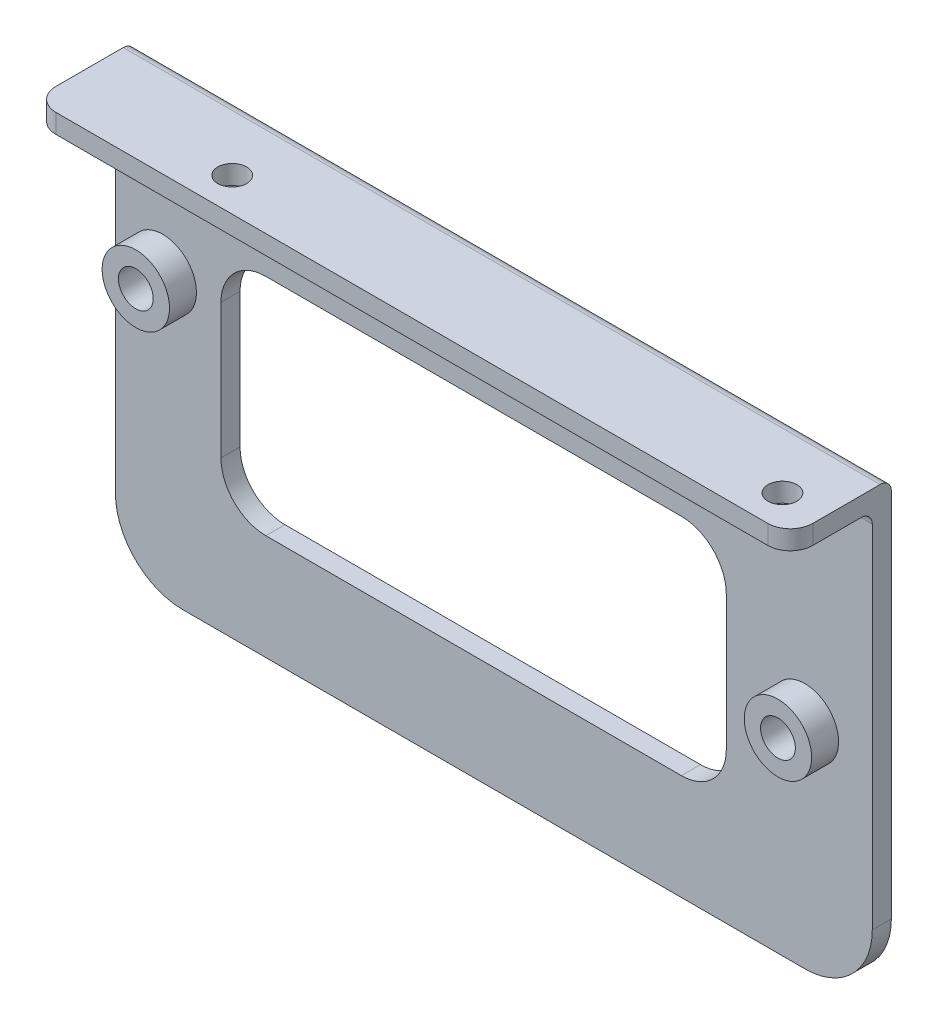
ISO-10303-21;
HEADER;
FILE_DESCRIPTION(('STEP AP214'),'2;1');
FILE_NAME('part.step','',(''),(''),'','','');
FILE_SCHEMA(('AUTOMOTIVE_DESIGN { 1 0 10303 214 1 1 1 1 }'));
ENDSEC;
DATA;
#1=APPLICATION_CONTEXT('core data for automotive mechanical design processes');
#2=APPLICATION_PROTOCOL_DEFINITION('international standard','automotive_design',2000,#1);
#3=PRODUCT_CONTEXT('',#1,'mechanical');
#4=PRODUCT('Part','Part','',(#3));
#5=PRODUCT_RELATED_PRODUCT_CATEGORY('part','',(#4));
#6=PRODUCT_DEFINITION_FORMATION('','',#4);
#7=PRODUCT_DEFINITION_CONTEXT('part definition',#1,'design');
#8=PRODUCT_DEFINITION('design','',#6,#7);
#9=PRODUCT_DEFINITION_SHAPE('','',#8);
#10=(LENGTH_UNIT() NAMED_UNIT(*) SI_UNIT(.MILLI.,.METRE.));
#11=(NAMED_UNIT(*) PLANE_ANGLE_UNIT() SI_UNIT($,.RADIAN.));
#12=(NAMED_UNIT(*) SI_UNIT($,.STERADIAN.) SOLID_ANGLE_UNIT());
#13=UNCERTAINTY_MEASURE_WITH_UNIT(LENGTH_MEASURE(1.E-05),#10,'distance_accuracy_value','');
#14=(GEOMETRIC_REPRESENTATION_CONTEXT(3) GLOBAL_UNCERTAINTY_ASSIGNED_CONTEXT((#13)) GLOBAL_UNIT_ASSIGNED_CONTEXT((#10,
#11,#12)) REPRESENTATION_CONTEXT('',''));
#15=CARTESIAN_POINT('',(0.,0.,0.));
#16=DIRECTION('',(0.,0.,1.));
#17=DIRECTION('',(1.,0.,0.));
#18=AXIS2_PLACEMENT_3D('',#15,#16,#17);
#19=CARTESIAN_POINT('',(0.,0.,2.159));
#20=DIRECTION('',(0.,0.,-1.));
#21=DIRECTION('',(-1.,0.,0.));
#22=AXIS2_PLACEMENT_3D('',#19,#20,#21);
#23=PLANE('',#22);
#24=CARTESIAN_POINT('',(-37.44214,6.42619999999999,2.159));
#25=DIRECTION('',(0.,0.,-1.));
#26=DIRECTION('',(-1.,0.,0.));
#27=AXIS2_PLACEMENT_3D('',#24,#25,#26);
#28=CIRCLE('',#27,3.81);
#29=CARTESIAN_POINT('',(-41.25214,6.42619999999999,2.159));
#30=VERTEX_POINT('',#29);
#31=EDGE_CURVE('E11',#30,#30,#28,.F.);
#32=ORIENTED_EDGE('',*,*,#31,.F.);
#33=EDGE_LOOP('',(#32));
#34=FACE_BOUND('',#33,.T.);
#35=CARTESIAN_POINT('',(35.179,-1.27000000000001,2.159));
#36=DIRECTION('',(0.,0.,-1.));
#37=DIRECTION('',(-1.,0.,0.));
#38=AXIS2_PLACEMENT_3D('',#35,#36,#37);
#39=CIRCLE('',#38,3.81);
#40=CARTESIAN_POINT('',(31.369,-1.27000000000001,2.159));
#41=VERTEX_POINT('',#40);
#42=EDGE_CURVE('E40',#41,#41,#39,.F.);
#43=ORIENTED_EDGE('',*,*,#42,.F.);
#44=EDGE_LOOP('',(#43));
#45=FACE_BOUND('',#44,.T.);
#46=DIRECTION('',(1.,0.,0.));
#47=VECTOR('',#46,1.);
#48=CARTESIAN_POINT('',(-30.861,-13.462,2.159));
#49=LINE('',#48,#47);
#50=CARTESIAN_POINT('',(-25.781,-13.462,2.159));
#51=VERTEX_POINT('',#50);
#52=CARTESIAN_POINT('',(21.209,-13.462,2.159));
#53=VERTEX_POINT('',#52);
#54=EDGE_CURVE('E297',#51,#53,#49,.T.);
#55=ORIENTED_EDGE('',*,*,#54,.F.);
#56=CARTESIAN_POINT('',(-25.781,-8.38200000000001,2.159));
#57=DIRECTION('',(0.,0.,-1.));
#58=DIRECTION('',(-1.,0.,0.));
#59=AXIS2_PLACEMENT_3D('',#56,#57,#58);
#60=CIRCLE('',#59,5.08);
#61=CARTESIAN_POINT('',(-30.861,-8.38200000000001,2.159));
#62=VERTEX_POINT('',#61);
#63=EDGE_CURVE('E274',#51,#62,#60,.T.);
#64=ORIENTED_EDGE('',*,*,#63,.T.);
#65=DIRECTION('',(0.,-1.,0.));
#66=VECTOR('',#65,1.);
#67=CARTESIAN_POINT('',(-30.861,-13.462,2.159));
#68=LINE('',#67,#66);
#69=CARTESIAN_POINT('',(-30.861,6.85799999999998,2.159));
#70=VERTEX_POINT('',#69);
#71=EDGE_CURVE('E347',#70,#62,#68,.T.);
#72=ORIENTED_EDGE('',*,*,#71,.F.);
#73=CARTESIAN_POINT('',(-25.781,6.85799999999998,2.159));
#74=DIRECTION('',(0.,0.,-1.));
#75=DIRECTION('',(-1.,0.,0.));
#76=AXIS2_PLACEMENT_3D('',#73,#74,#75);
#77=CIRCLE('',#76,5.08);
#78=CARTESIAN_POINT('',(-25.781,11.938,2.159));
#79=VERTEX_POINT('',#78);
#80=EDGE_CURVE('E281',#70,#79,#77,.T.);
#81=ORIENTED_EDGE('',*,*,#80,.T.);
#82=DIRECTION('',(-1.,0.,0.));
#83=VECTOR('',#82,1.);
#84=CARTESIAN_POINT('',(-30.861,11.938,2.159));
#85=LINE('',#84,#83);
#86=CARTESIAN_POINT('',(21.209,11.938,2.159));
#87=VERTEX_POINT('',#86);
#88=EDGE_CURVE('E340',#87,#79,#85,.T.);
#89=ORIENTED_EDGE('',*,*,#88,.F.);
#90=CARTESIAN_POINT('',(21.209,6.85799999999998,2.159));
#91=DIRECTION('',(0.,0.,-1.));
#92=DIRECTION('',(-1.,0.,0.));
#93=AXIS2_PLACEMENT_3D('',#90,#91,#92);
#94=CIRCLE('',#93,5.08);
#95=CARTESIAN_POINT('',(26.289,6.85799999999998,2.159));
#96=VERTEX_POINT('',#95);
#97=EDGE_CURVE('E278',#87,#96,#94,.T.);
#98=ORIENTED_EDGE('',*,*,#97,.T.);
#99=DIRECTION('',(0.,1.,0.));
#100=VECTOR('',#99,1.);
#101=CARTESIAN_POINT('',(26.289,-13.462,2.159));
#102=LINE('',#101,#100);
#103=CARTESIAN_POINT('',(26.289,-8.38200000000001,2.159));
#104=VERTEX_POINT('',#103);
#105=EDGE_CURVE('E343',#104,#96,#102,.T.);
#106=ORIENTED_EDGE('',*,*,#105,.F.);
#107=CARTESIAN_POINT('',(21.209,-8.38200000000001,2.159));
#108=DIRECTION('',(0.,0.,-1.));
#109=DIRECTION('',(-1.,0.,0.));
#110=AXIS2_PLACEMENT_3D('',#107,#108,#109);
#111=CIRCLE('',#110,5.08);
#112=EDGE_CURVE('E270',#104,#53,#111,.T.);
#113=ORIENTED_EDGE('',*,*,#112,.T.);
#114=EDGE_LOOP('',(#55,#64,#72,#81,#89,#98,#106,#113));
#115=FACE_BOUND('',#114,.T.);
#116=DIRECTION('',(0.,-1.,0.));
#117=VECTOR('',#116,1.);
#118=CARTESIAN_POINT('',(-42.799,25.4,2.159));
#119=LINE('',#118,#117);
#120=CARTESIAN_POINT('',(-42.799,21.971,2.159));
#121=VERTEX_POINT('',#120);
#122=CARTESIAN_POINT('',(-42.799,-17.78,2.159));
#123=VERTEX_POINT('',#122);
#124=EDGE_CURVE('E300',#121,#123,#119,.T.);
#125=ORIENTED_EDGE('',*,*,#124,.T.);
#126=CARTESIAN_POINT('',(-35.179,-17.78,2.159));
#127=DIRECTION('',(0.,0.,-1.));
#128=DIRECTION('',(-1.,0.,0.));
#129=AXIS2_PLACEMENT_3D('',#126,#127,#128);
#130=CIRCLE('',#129,7.62);
#131=CARTESIAN_POINT('',(-35.179,-25.4,2.159));
#132=VERTEX_POINT('',#131);
#133=EDGE_CURVE('E246',#123,#132,#130,.F.);
#134=ORIENTED_EDGE('',*,*,#133,.T.);
#135=DIRECTION('',(1.,0.,0.));
#136=VECTOR('',#135,1.);
#137=CARTESIAN_POINT('',(42.799,-25.4,2.159));
#138=LINE('',#137,#136);
#139=CARTESIAN_POINT('',(35.179,-25.4,2.159));
#140=VERTEX_POINT('',#139);
#141=EDGE_CURVE('E305',#132,#140,#138,.T.);
#142=ORIENTED_EDGE('',*,*,#141,.T.);
#143=CARTESIAN_POINT('',(35.179,-17.78,2.159));
#144=DIRECTION('',(0.,0.,-1.));
#145=DIRECTION('',(-1.,0.,0.));
#146=AXIS2_PLACEMENT_3D('',#143,#144,#145);
#147=CIRCLE('',#146,7.62);
#148=CARTESIAN_POINT('',(42.799,-17.78,2.159));
#149=VERTEX_POINT('',#148);
#150=EDGE_CURVE('E244',#140,#149,#147,.F.);
#151=ORIENTED_EDGE('',*,*,#150,.T.);
#152=DIRECTION('',(0.,1.,0.));
#153=VECTOR('',#152,1.);
#154=CARTESIAN_POINT('',(42.799,25.4,2.159));
#155=LINE('',#154,#153);
#156=CARTESIAN_POINT('',(42.799,21.971,2.159));
#157=VERTEX_POINT('',#156);
#158=EDGE_CURVE('E328',#149,#157,#155,.T.);
#159=ORIENTED_EDGE('',*,*,#158,.T.);
#160=DIRECTION('',(1.,0.,0.));
#161=VECTOR('',#160,1.);
#162=CARTESIAN_POINT('',(-42.799,21.971,2.159));
#163=LINE('',#162,#161);
#164=EDGE_CURVE('E191',#157,#121,#163,.F.);
#165=ORIENTED_EDGE('',*,*,#164,.T.);
#166=EDGE_LOOP('',(#125,#134,#142,#151,#159,#165));
#167=FACE_BOUND('',#166,.T.);
#168=ADVANCED_FACE('F32',(#34,#45,#115,#167),#23,.F.);
#169=CARTESIAN_POINT('',(-42.799,25.4,2.159));
#170=DIRECTION('',(1.,0.,0.));
#171=DIRECTION('',(0.,1.,0.));
#172=AXIS2_PLACEMENT_3D('',#169,#170,#171);
#173=PLANE('',#172);
#174=DIRECTION('',(0.,-1.,0.));
#175=VECTOR('',#174,1.);
#176=CARTESIAN_POINT('',(-42.799,25.4,0.));
#177=LINE('',#176,#175);
#178=CARTESIAN_POINT('',(-42.799,24.13,0.));
#179=VERTEX_POINT('',#178);
#180=CARTESIAN_POINT('',(-42.799,-17.78,0.));
#181=VERTEX_POINT('',#180);
#182=EDGE_CURVE('E323',#179,#181,#177,.T.);
#183=ORIENTED_EDGE('',*,*,#182,.T.);
#184=DIRECTION('',(0.,0.,-1.));
#185=VECTOR('',#184,1.);
#186=CARTESIAN_POINT('',(-42.799,-17.78,2.159));
#187=LINE('',#186,#185);
#188=EDGE_CURVE('E242',#181,#123,#187,.F.);
#189=ORIENTED_EDGE('',*,*,#188,.T.);
#190=ORIENTED_EDGE('',*,*,#124,.F.);
#191=CARTESIAN_POINT('',(-42.799,21.971,3.429));
#192=DIRECTION('',(1.,0.,0.));
#193=DIRECTION('',(0.,1.,0.));
#194=AXIS2_PLACEMENT_3D('',#191,#192,#193);
#195=CIRCLE('',#194,1.27);
#196=CARTESIAN_POINT('',(-42.799,23.241,3.429));
#197=VERTEX_POINT('',#196);
#198=EDGE_CURVE('E192',#121,#197,#195,.T.);
#199=ORIENTED_EDGE('',*,*,#198,.T.);
#200=DIRECTION('',(0.,0.,-1.));
#201=VECTOR('',#200,1.);
#202=CARTESIAN_POINT('',(-42.799,23.241,11.43));
#203=LINE('',#202,#201);
#204=CARTESIAN_POINT('',(-42.799,23.241,8.89));
#205=VERTEX_POINT('',#204);
#206=EDGE_CURVE('E183',#205,#197,#203,.T.);
#207=ORIENTED_EDGE('',*,*,#206,.F.);
#208=DIRECTION('',(0.,-1.,0.));
#209=VECTOR('',#208,1.);
#210=CARTESIAN_POINT('',(-42.799,25.4,8.89));
#211=LINE('',#210,#209);
#212=CARTESIAN_POINT('',(-42.799,25.4,8.89));
#213=VERTEX_POINT('',#212);
#214=EDGE_CURVE('E231',#205,#213,#211,.F.);
#215=ORIENTED_EDGE('',*,*,#214,.T.);
#216=DIRECTION('',(0.,0.,-1.));
#217=VECTOR('',#216,1.);
#218=CARTESIAN_POINT('',(-42.799,25.4,2.159));
#219=LINE('',#218,#217);
#220=CARTESIAN_POINT('',(-42.799,25.4,1.27));
#221=VERTEX_POINT('',#220);
#222=EDGE_CURVE('E200',#213,#221,#219,.T.);
#223=ORIENTED_EDGE('',*,*,#222,.T.);
#224=CARTESIAN_POINT('',(-42.799,24.13,1.27));
#225=DIRECTION('',(1.,0.,0.));
#226=DIRECTION('',(0.,1.,0.));
#227=AXIS2_PLACEMENT_3D('',#224,#225,#226);
#228=CIRCLE('',#227,1.27);
#229=EDGE_CURVE('E208',#221,#179,#228,.F.);
#230=ORIENTED_EDGE('',*,*,#229,.T.);
#231=EDGE_LOOP('',(#183,#189,#190,#199,#207,#215,#223,#230));
#232=FACE_BOUND('',#231,.T.);
#233=ADVANCED_FACE('F291',(#232),#173,.F.);
#234=CARTESIAN_POINT('',(42.799,-25.4,2.159));
#235=DIRECTION('',(0.,1.,0.));
#236=DIRECTION('',(-1.,0.,0.));
#237=AXIS2_PLACEMENT_3D('',#234,#235,#236);
#238=PLANE('',#237);
#239=ORIENTED_EDGE('',*,*,#141,.F.);
#240=DIRECTION('',(0.,0.,-1.));
#241=VECTOR('',#240,1.);
#242=CARTESIAN_POINT('',(-35.179,-25.4,2.159));
#243=LINE('',#242,#241);
#244=CARTESIAN_POINT('',(-35.179,-25.4,0.));
#245=VERTEX_POINT('',#244);
#246=EDGE_CURVE('E235',#132,#245,#243,.T.);
#247=ORIENTED_EDGE('',*,*,#246,.T.);
#248=DIRECTION('',(1.,0.,0.));
#249=VECTOR('',#248,1.);
#250=CARTESIAN_POINT('',(42.799,-25.4,0.));
#251=LINE('',#250,#249);
#252=CARTESIAN_POINT('',(35.179,-25.4,0.));
#253=VERTEX_POINT('',#252);
#254=EDGE_CURVE('E316',#245,#253,#251,.T.);
#255=ORIENTED_EDGE('',*,*,#254,.T.);
#256=DIRECTION('',(0.,0.,-1.));
#257=VECTOR('',#256,1.);
#258=CARTESIAN_POINT('',(35.179,-25.4,2.159));
#259=LINE('',#258,#257);
#260=EDGE_CURVE('E233',#253,#140,#259,.F.);
#261=ORIENTED_EDGE('',*,*,#260,.T.);
#262=EDGE_LOOP('',(#239,#247,#255,#261));
#263=FACE_BOUND('',#262,.T.);
#264=ADVANCED_FACE('F315',(#263),#238,.F.);
#265=CARTESIAN_POINT('',(42.799,25.4,2.159));
#266=DIRECTION('',(-1.,0.,0.));
#267=DIRECTION('',(0.,0.,1.));
#268=AXIS2_PLACEMENT_3D('',#265,#266,#267);
#269=PLANE('',#268);
#270=ORIENTED_EDGE('',*,*,#158,.F.);
#271=DIRECTION('',(0.,0.,-1.));
#272=VECTOR('',#271,1.);
#273=CARTESIAN_POINT('',(42.799,-17.78,2.159));
#274=LINE('',#273,#272);
#275=CARTESIAN_POINT('',(42.799,-17.78,0.));
#276=VERTEX_POINT('',#275);
#277=EDGE_CURVE('E248',#149,#276,#274,.T.);
#278=ORIENTED_EDGE('',*,*,#277,.T.);
#279=DIRECTION('',(0.,1.,0.));
#280=VECTOR('',#279,1.);
#281=CARTESIAN_POINT('',(42.799,25.4,0.));
#282=LINE('',#281,#280);
#283=CARTESIAN_POINT('',(42.799,24.13,0.));
#284=VERTEX_POINT('',#283);
#285=EDGE_CURVE('E306',#276,#284,#282,.T.);
#286=ORIENTED_EDGE('',*,*,#285,.T.);
#287=CARTESIAN_POINT('',(42.799,24.13,1.27));
#288=DIRECTION('',(-1.,0.,0.));
#289=DIRECTION('',(0.,0.,1.));
#290=AXIS2_PLACEMENT_3D('',#287,#288,#289);
#291=CIRCLE('',#290,1.27);
#292=CARTESIAN_POINT('',(42.799,25.4,1.27));
#293=VERTEX_POINT('',#292);
#294=EDGE_CURVE('E213',#284,#293,#291,.F.);
#295=ORIENTED_EDGE('',*,*,#294,.T.);
#296=DIRECTION('',(0.,0.,-1.));
#297=VECTOR('',#296,1.);
#298=CARTESIAN_POINT('',(42.799,25.4,2.159));
#299=LINE('',#298,#297);
#300=CARTESIAN_POINT('',(42.799,25.4,8.89));
#301=VERTEX_POINT('',#300);
#302=EDGE_CURVE('E197',#301,#293,#299,.T.);
#303=ORIENTED_EDGE('',*,*,#302,.F.);
#304=DIRECTION('',(0.,1.,0.));
#305=VECTOR('',#304,1.);
#306=CARTESIAN_POINT('',(42.799,25.4,8.89));
#307=LINE('',#306,#305);
#308=CARTESIAN_POINT('',(42.799,23.241,8.89));
#309=VERTEX_POINT('',#308);
#310=EDGE_CURVE('E179',#301,#309,#307,.F.);
#311=ORIENTED_EDGE('',*,*,#310,.T.);
#312=DIRECTION('',(0.,0.,-1.));
#313=VECTOR('',#312,1.);
#314=CARTESIAN_POINT('',(42.799,23.241,11.43));
#315=LINE('',#314,#313);
#316=CARTESIAN_POINT('',(42.799,23.241,3.429));
#317=VERTEX_POINT('',#316);
#318=EDGE_CURVE('E171',#309,#317,#315,.T.);
#319=ORIENTED_EDGE('',*,*,#318,.T.);
#320=CARTESIAN_POINT('',(42.799,21.971,3.429));
#321=DIRECTION('',(-1.,0.,0.));
#322=DIRECTION('',(0.,0.,1.));
#323=AXIS2_PLACEMENT_3D('',#320,#321,#322);
#324=CIRCLE('',#323,1.27);
#325=EDGE_CURVE('E175',#317,#157,#324,.T.);
#326=ORIENTED_EDGE('',*,*,#325,.T.);
#327=EDGE_LOOP('',(#270,#278,#286,#295,#303,#311,#319,#326));
#328=FACE_BOUND('',#327,.T.);
#329=ADVANCED_FACE('F174',(#328),#269,.F.);
#330=CARTESIAN_POINT('',(42.799,25.4,2.159));
#331=DIRECTION('',(0.,-1.,0.));
#332=DIRECTION('',(1.,0.,0.));
#333=AXIS2_PLACEMENT_3D('',#330,#331,#332);
#334=PLANE('',#333);
#335=CARTESIAN_POINT('',(38.1,25.4,7.62));
#336=DIRECTION('',(0.,-1.,0.));
#337=DIRECTION('',(0.,0.,-1.));
#338=AXIS2_PLACEMENT_3D('',#335,#336,#337);
#339=CIRCLE('',#338,1.63194999999998);
#340=CARTESIAN_POINT('',(38.1,25.4,5.98805000000002));
#341=VERTEX_POINT('',#340);
#342=EDGE_CURVE('E364',#341,#341,#339,.T.);
#343=ORIENTED_EDGE('',*,*,#342,.T.);
#344=EDGE_LOOP('',(#343));
#345=FACE_BOUND('',#344,.T.);
#346=CARTESIAN_POINT('',(-24.13,25.4,7.62));
#347=DIRECTION('',(0.,-1.,0.));
#348=DIRECTION('',(0.,0.,-1.));
#349=AXIS2_PLACEMENT_3D('',#346,#347,#348);
#350=CIRCLE('',#349,1.63194999999998);
#351=CARTESIAN_POINT('',(-24.13,25.4,5.98805000000002));
#352=VERTEX_POINT('',#351);
#353=EDGE_CURVE('E350',#352,#352,#350,.T.);
#354=ORIENTED_EDGE('',*,*,#353,.T.);
#355=EDGE_LOOP('',(#354));
#356=FACE_BOUND('',#355,.T.);
#357=DIRECTION('',(-1.,0.,0.));
#358=VECTOR('',#357,1.);
#359=CARTESIAN_POINT('',(42.799,25.4,11.43));
#360=LINE('',#359,#358);
#361=CARTESIAN_POINT('',(40.259,25.4,11.43));
#362=VERTEX_POINT('',#361);
#363=CARTESIAN_POINT('',(-40.259,25.4,11.43));
#364=VERTEX_POINT('',#363);
#365=EDGE_CURVE('E336',#362,#364,#360,.T.);
#366=ORIENTED_EDGE('',*,*,#365,.F.);
#367=CARTESIAN_POINT('',(40.259,25.4,8.89));
#368=DIRECTION('',(0.,-1.,0.));
#369=DIRECTION('',(1.,0.,0.));
#370=AXIS2_PLACEMENT_3D('',#367,#368,#369);
#371=CIRCLE('',#370,2.54);
#372=EDGE_CURVE('E224',#362,#301,#371,.F.);
#373=ORIENTED_EDGE('',*,*,#372,.T.);
#374=ORIENTED_EDGE('',*,*,#302,.T.);
#375=DIRECTION('',(-1.,0.,0.));
#376=VECTOR('',#375,1.);
#377=CARTESIAN_POINT('',(-42.799,25.4,1.27));
#378=LINE('',#377,#376);
#379=EDGE_CURVE('E205',#293,#221,#378,.T.);
#380=ORIENTED_EDGE('',*,*,#379,.T.);
#381=ORIENTED_EDGE('',*,*,#222,.F.);
#382=CARTESIAN_POINT('',(-40.259,25.4,8.89));
#383=DIRECTION('',(0.,-1.,0.));
#384=DIRECTION('',(1.,0.,0.));
#385=AXIS2_PLACEMENT_3D('',#382,#383,#384);
#386=CIRCLE('',#385,2.54);
#387=EDGE_CURVE('E222',#213,#364,#386,.F.);
#388=ORIENTED_EDGE('',*,*,#387,.T.);
#389=EDGE_LOOP('',(#366,#373,#374,#380,#381,#388));
#390=FACE_BOUND('',#389,.T.);
#391=ADVANCED_FACE('F479',(#345,#356,#390),#334,.F.);
#392=CARTESIAN_POINT('',(0.,0.,0.));
#393=DIRECTION('',(0.,0.,-1.));
#394=DIRECTION('',(-1.,0.,0.));
#395=AXIS2_PLACEMENT_3D('',#392,#393,#394);
#396=PLANE('',#395);
#397=CARTESIAN_POINT('',(-37.44214,6.42619999999999,0.));
#398=DIRECTION('',(0.,0.,1.));
#399=DIRECTION('',(1.,0.,0.));
#400=AXIS2_PLACEMENT_3D('',#397,#398,#399);
#401=CIRCLE('',#400,0.952500000000004);
#402=CARTESIAN_POINT('',(-36.48964,6.42619999999999,0.));
#403=VERTEX_POINT('',#402);
#404=EDGE_CURVE('E381',#403,#403,#401,.T.);
#405=ORIENTED_EDGE('',*,*,#404,.T.);
#406=EDGE_LOOP('',(#405));
#407=FACE_BOUND('',#406,.T.);
#408=CARTESIAN_POINT('',(35.179,-1.27000000000001,0.));
#409=DIRECTION('',(0.,0.,1.));
#410=DIRECTION('',(1.,0.,0.));
#411=AXIS2_PLACEMENT_3D('',#408,#409,#410);
#412=CIRCLE('',#411,0.952500000000004);
#413=CARTESIAN_POINT('',(36.1315,-1.27000000000001,0.));
#414=VERTEX_POINT('',#413);
#415=EDGE_CURVE('E392',#414,#414,#412,.T.);
#416=ORIENTED_EDGE('',*,*,#415,.T.);
#417=EDGE_LOOP('',(#416));
#418=FACE_BOUND('',#417,.T.);
#419=DIRECTION('',(-1.,0.,0.));
#420=VECTOR('',#419,1.);
#421=CARTESIAN_POINT('',(-30.861,11.938,0.));
#422=LINE('',#421,#420);
#423=CARTESIAN_POINT('',(21.209,11.938,0.));
#424=VERTEX_POINT('',#423);
#425=CARTESIAN_POINT('',(-25.781,11.938,0.));
#426=VERTEX_POINT('',#425);
#427=EDGE_CURVE('E339',#424,#426,#422,.T.);
#428=ORIENTED_EDGE('',*,*,#427,.T.);
#429=CARTESIAN_POINT('',(-25.781,6.85799999999998,0.));
#430=DIRECTION('',(0.,0.,-1.));
#431=DIRECTION('',(-1.,0.,0.));
#432=AXIS2_PLACEMENT_3D('',#429,#430,#431);
#433=CIRCLE('',#432,5.08);
#434=CARTESIAN_POINT('',(-30.861,6.85799999999998,0.));
#435=VERTEX_POINT('',#434);
#436=EDGE_CURVE('E283',#426,#435,#433,.F.);
#437=ORIENTED_EDGE('',*,*,#436,.T.);
#438=DIRECTION('',(0.,-1.,0.));
#439=VECTOR('',#438,1.);
#440=CARTESIAN_POINT('',(-30.861,-13.462,0.));
#441=LINE('',#440,#439);
#442=CARTESIAN_POINT('',(-30.861,-8.38200000000001,0.));
#443=VERTEX_POINT('',#442);
#444=EDGE_CURVE('E342',#435,#443,#441,.T.);
#445=ORIENTED_EDGE('',*,*,#444,.T.);
#446=CARTESIAN_POINT('',(-25.781,-8.38200000000001,0.));
#447=DIRECTION('',(0.,0.,-1.));
#448=DIRECTION('',(-1.,0.,0.));
#449=AXIS2_PLACEMENT_3D('',#446,#447,#448);
#450=CIRCLE('',#449,5.08);
#451=CARTESIAN_POINT('',(-25.781,-13.462,0.));
#452=VERTEX_POINT('',#451);
#453=EDGE_CURVE('E276',#443,#452,#450,.F.);
#454=ORIENTED_EDGE('',*,*,#453,.T.);
#455=DIRECTION('',(1.,0.,0.));
#456=VECTOR('',#455,1.);
#457=CARTESIAN_POINT('',(-30.861,-13.462,0.));
#458=LINE('',#457,#456);
#459=CARTESIAN_POINT('',(21.209,-13.462,0.));
#460=VERTEX_POINT('',#459);
#461=EDGE_CURVE('E354',#452,#460,#458,.T.);
#462=ORIENTED_EDGE('',*,*,#461,.T.);
#463=CARTESIAN_POINT('',(21.209,-8.38200000000001,0.));
#464=DIRECTION('',(0.,0.,-1.));
#465=DIRECTION('',(-1.,0.,0.));
#466=AXIS2_PLACEMENT_3D('',#463,#464,#465);
#467=CIRCLE('',#466,5.08);
#468=CARTESIAN_POINT('',(26.289,-8.38200000000001,0.));
#469=VERTEX_POINT('',#468);
#470=EDGE_CURVE('E272',#460,#469,#467,.F.);
#471=ORIENTED_EDGE('',*,*,#470,.T.);
#472=DIRECTION('',(0.,1.,0.));
#473=VECTOR('',#472,1.);
#474=CARTESIAN_POINT('',(26.289,-13.462,0.));
#475=LINE('',#474,#473);
#476=CARTESIAN_POINT('',(26.289,6.85799999999998,0.));
#477=VERTEX_POINT('',#476);
#478=EDGE_CURVE('E352',#469,#477,#475,.T.);
#479=ORIENTED_EDGE('',*,*,#478,.T.);
#480=CARTESIAN_POINT('',(21.209,6.85799999999998,0.));
#481=DIRECTION('',(0.,0.,-1.));
#482=DIRECTION('',(-1.,0.,0.));
#483=AXIS2_PLACEMENT_3D('',#480,#481,#482);
#484=CIRCLE('',#483,5.08);
#485=EDGE_CURVE('E54',#477,#424,#484,.F.);
#486=ORIENTED_EDGE('',*,*,#485,.T.);
#487=EDGE_LOOP('',(#428,#437,#445,#454,#462,#471,#479,#486));
#488=FACE_BOUND('',#487,.T.);
#489=ORIENTED_EDGE('',*,*,#254,.F.);
#490=CARTESIAN_POINT('',(-35.179,-17.78,0.));
#491=DIRECTION('',(0.,0.,-1.));
#492=DIRECTION('',(-1.,0.,0.));
#493=AXIS2_PLACEMENT_3D('',#490,#491,#492);
#494=CIRCLE('',#493,7.62);
#495=EDGE_CURVE('E240',#245,#181,#494,.T.);
#496=ORIENTED_EDGE('',*,*,#495,.T.);
#497=ORIENTED_EDGE('',*,*,#182,.F.);
#498=DIRECTION('',(-1.,0.,0.));
#499=VECTOR('',#498,1.);
#500=CARTESIAN_POINT('',(42.799,24.13,0.));
#501=LINE('',#500,#499);
#502=EDGE_CURVE('E210',#179,#284,#501,.F.);
#503=ORIENTED_EDGE('',*,*,#502,.T.);
#504=ORIENTED_EDGE('',*,*,#285,.F.);
#505=CARTESIAN_POINT('',(35.179,-17.78,0.));
#506=DIRECTION('',(0.,0.,-1.));
#507=DIRECTION('',(-1.,0.,0.));
#508=AXIS2_PLACEMENT_3D('',#505,#506,#507);
#509=CIRCLE('',#508,7.62);
#510=EDGE_CURVE('E238',#276,#253,#509,.T.);
#511=ORIENTED_EDGE('',*,*,#510,.T.);
#512=EDGE_LOOP('',(#489,#496,#497,#503,#504,#511));
#513=FACE_BOUND('',#512,.T.);
#514=ADVANCED_FACE('F319',(#407,#418,#488,#513),#396,.T.);
#515=CARTESIAN_POINT('',(42.799,23.241,11.43));
#516=DIRECTION('',(0.,1.,0.));
#517=DIRECTION('',(-1.,0.,0.));
#518=AXIS2_PLACEMENT_3D('',#515,#516,#517);
#519=PLANE('',#518);
#520=CARTESIAN_POINT('',(38.1,23.241,7.62));
#521=DIRECTION('',(0.,-1.,0.));
#522=DIRECTION('',(0.,0.,-1.));
#523=AXIS2_PLACEMENT_3D('',#520,#521,#522);
#524=CIRCLE('',#523,1.63194999999998);
#525=CARTESIAN_POINT('',(38.1,23.241,5.98805000000002));
#526=VERTEX_POINT('',#525);
#527=EDGE_CURVE('E367',#526,#526,#524,.T.);
#528=ORIENTED_EDGE('',*,*,#527,.F.);
#529=EDGE_LOOP('',(#528));
#530=FACE_BOUND('',#529,.T.);
#531=CARTESIAN_POINT('',(-24.13,23.241,7.62));
#532=DIRECTION('',(0.,-1.,0.));
#533=DIRECTION('',(0.,0.,-1.));
#534=AXIS2_PLACEMENT_3D('',#531,#532,#533);
#535=CIRCLE('',#534,1.63194999999998);
#536=CARTESIAN_POINT('',(-24.13,23.241,5.98805000000002));
#537=VERTEX_POINT('',#536);
#538=EDGE_CURVE('E361',#537,#537,#535,.T.);
#539=ORIENTED_EDGE('',*,*,#538,.F.);
#540=EDGE_LOOP('',(#539));
#541=FACE_BOUND('',#540,.T.);
#542=ORIENTED_EDGE('',*,*,#318,.F.);
#543=CARTESIAN_POINT('',(40.259,23.241,8.89));
#544=DIRECTION('',(0.,1.,0.));
#545=DIRECTION('',(-1.,0.,0.));
#546=AXIS2_PLACEMENT_3D('',#543,#544,#545);
#547=CIRCLE('',#546,2.54);
#548=CARTESIAN_POINT('',(40.259,23.241,11.43));
#549=VERTEX_POINT('',#548);
#550=EDGE_CURVE('E229',#309,#549,#547,.F.);
#551=ORIENTED_EDGE('',*,*,#550,.T.);
#552=DIRECTION('',(1.,0.,0.));
#553=VECTOR('',#552,1.);
#554=CARTESIAN_POINT('',(42.799,23.241,11.43));
#555=LINE('',#554,#553);
#556=CARTESIAN_POINT('',(-40.259,23.241,11.43));
#557=VERTEX_POINT('',#556);
#558=EDGE_CURVE('E184',#557,#549,#555,.T.);
#559=ORIENTED_EDGE('',*,*,#558,.F.);
#560=CARTESIAN_POINT('',(-40.259,23.241,8.89));
#561=DIRECTION('',(0.,1.,0.));
#562=DIRECTION('',(-1.,0.,0.));
#563=AXIS2_PLACEMENT_3D('',#560,#561,#562);
#564=CIRCLE('',#563,2.54);
#565=EDGE_CURVE('E227',#557,#205,#564,.F.);
#566=ORIENTED_EDGE('',*,*,#565,.T.);
#567=ORIENTED_EDGE('',*,*,#206,.T.);
#568=DIRECTION('',(1.,0.,0.));
#569=VECTOR('',#568,1.);
#570=CARTESIAN_POINT('',(42.799,23.241,3.429));
#571=LINE('',#570,#569);
#572=EDGE_CURVE('E190',#197,#317,#571,.T.);
#573=ORIENTED_EDGE('',*,*,#572,.T.);
#574=EDGE_LOOP('',(#542,#551,#559,#566,#567,#573));
#575=FACE_BOUND('',#574,.T.);
#576=ADVANCED_FACE('F194',(#530,#541,#575),#519,.F.);
#577=CARTESIAN_POINT('',(0.,0.,11.43));
#578=DIRECTION('',(0.,0.,-1.));
#579=DIRECTION('',(-1.,0.,0.));
#580=AXIS2_PLACEMENT_3D('',#577,#578,#579);
#581=PLANE('',#580);
#582=ORIENTED_EDGE('',*,*,#558,.T.);
#583=DIRECTION('',(0.,1.,0.));
#584=VECTOR('',#583,1.);
#585=CARTESIAN_POINT('',(40.259,0.,11.43));
#586=LINE('',#585,#584);
#587=EDGE_CURVE('E219',#549,#362,#586,.T.);
#588=ORIENTED_EDGE('',*,*,#587,.T.);
#589=ORIENTED_EDGE('',*,*,#365,.T.);
#590=DIRECTION('',(0.,-1.,0.));
#591=VECTOR('',#590,1.);
#592=CARTESIAN_POINT('',(-40.259,0.,11.43));
#593=LINE('',#592,#591);
#594=EDGE_CURVE('E216',#364,#557,#593,.T.);
#595=ORIENTED_EDGE('',*,*,#594,.T.);
#596=EDGE_LOOP('',(#582,#588,#589,#595));
#597=FACE_BOUND('',#596,.T.);
#598=ADVANCED_FACE('F470',(#597),#581,.F.);
#599=CARTESIAN_POINT('',(42.799,21.971,3.429));
#600=DIRECTION('',(-1.,0.,0.));
#601=DIRECTION('',(0.,-1.,0.));
#602=AXIS2_PLACEMENT_3D('',#599,#600,#601);
#603=CYLINDRICAL_SURFACE('',#602,1.27);
#604=ORIENTED_EDGE('',*,*,#198,.F.);
#605=ORIENTED_EDGE('',*,*,#164,.F.);
#606=ORIENTED_EDGE('',*,*,#325,.F.);
#607=ORIENTED_EDGE('',*,*,#572,.F.);
#608=EDGE_LOOP('',(#604,#605,#606,#607));
#609=FACE_BOUND('',#608,.T.);
#610=ADVANCED_FACE('F189',(#609),#603,.F.);
#611=CARTESIAN_POINT('',(42.799,24.13,1.27));
#612=DIRECTION('',(1.,0.,0.));
#613=DIRECTION('',(0.,1.,0.));
#614=AXIS2_PLACEMENT_3D('',#611,#612,#613);
#615=CYLINDRICAL_SURFACE('',#614,1.27);
#616=ORIENTED_EDGE('',*,*,#294,.F.);
#617=ORIENTED_EDGE('',*,*,#502,.F.);
#618=ORIENTED_EDGE('',*,*,#229,.F.);
#619=ORIENTED_EDGE('',*,*,#379,.F.);
#620=EDGE_LOOP('',(#616,#617,#618,#619));
#621=FACE_BOUND('',#620,.T.);
#622=ADVANCED_FACE('F491',(#621),#615,.T.);
#623=CARTESIAN_POINT('',(40.259,0.,8.89));
#624=DIRECTION('',(0.,1.,0.));
#625=DIRECTION('',(0.,0.,1.));
#626=AXIS2_PLACEMENT_3D('',#623,#624,#625);
#627=CYLINDRICAL_SURFACE('',#626,2.54);
#628=ORIENTED_EDGE('',*,*,#550,.F.);
#629=ORIENTED_EDGE('',*,*,#310,.F.);
#630=ORIENTED_EDGE('',*,*,#372,.F.);
#631=ORIENTED_EDGE('',*,*,#587,.F.);
#632=EDGE_LOOP('',(#628,#629,#630,#631));
#633=FACE_BOUND('',#632,.T.);
#634=ADVANCED_FACE('F494',(#633),#627,.T.);
#635=CARTESIAN_POINT('',(-40.259,0.,8.89));
#636=DIRECTION('',(0.,-1.,0.));
#637=DIRECTION('',(1.,0.,0.));
#638=AXIS2_PLACEMENT_3D('',#635,#636,#637);
#639=CYLINDRICAL_SURFACE('',#638,2.54);
#640=ORIENTED_EDGE('',*,*,#387,.F.);
#641=ORIENTED_EDGE('',*,*,#214,.F.);
#642=ORIENTED_EDGE('',*,*,#565,.F.);
#643=ORIENTED_EDGE('',*,*,#594,.F.);
#644=EDGE_LOOP('',(#640,#641,#642,#643));
#645=FACE_BOUND('',#644,.T.);
#646=ADVANCED_FACE('F498',(#645),#639,.T.);
#647=CARTESIAN_POINT('',(-35.179,-17.78,2.159));
#648=DIRECTION('',(0.,0.,-1.));
#649=DIRECTION('',(-1.,0.,0.));
#650=AXIS2_PLACEMENT_3D('',#647,#648,#649);
#651=CYLINDRICAL_SURFACE('',#650,7.62);
#652=ORIENTED_EDGE('',*,*,#133,.F.);
#653=ORIENTED_EDGE('',*,*,#188,.F.);
#654=ORIENTED_EDGE('',*,*,#495,.F.);
#655=ORIENTED_EDGE('',*,*,#246,.F.);
#656=EDGE_LOOP('',(#652,#653,#654,#655));
#657=FACE_BOUND('',#656,.T.);
#658=ADVANCED_FACE('F311',(#657),#651,.T.);
#659=CARTESIAN_POINT('',(35.179,-17.78,2.159));
#660=DIRECTION('',(0.,0.,-1.));
#661=DIRECTION('',(-1.,0.,0.));
#662=AXIS2_PLACEMENT_3D('',#659,#660,#661);
#663=CYLINDRICAL_SURFACE('',#662,7.62);
#664=ORIENTED_EDGE('',*,*,#150,.F.);
#665=ORIENTED_EDGE('',*,*,#260,.F.);
#666=ORIENTED_EDGE('',*,*,#510,.F.);
#667=ORIENTED_EDGE('',*,*,#277,.F.);
#668=EDGE_LOOP('',(#664,#665,#666,#667));
#669=FACE_BOUND('',#668,.T.);
#670=ADVANCED_FACE('F468',(#669),#663,.T.);
#671=CARTESIAN_POINT('',(-30.861,-13.462,0.));
#672=DIRECTION('',(-1.,0.,0.));
#673=DIRECTION('',(0.,0.,1.));
#674=AXIS2_PLACEMENT_3D('',#671,#672,#673);
#675=PLANE('',#674);
#676=ORIENTED_EDGE('',*,*,#71,.T.);
#677=DIRECTION('',(0.,0.,1.));
#678=VECTOR('',#677,1.);
#679=CARTESIAN_POINT('',(-30.861,-8.38200000000001,0.));
#680=LINE('',#679,#678);
#681=EDGE_CURVE('E264',#62,#443,#680,.F.);
#682=ORIENTED_EDGE('',*,*,#681,.T.);
#683=ORIENTED_EDGE('',*,*,#444,.F.);
#684=DIRECTION('',(0.,0.,1.));
#685=VECTOR('',#684,1.);
#686=CARTESIAN_POINT('',(-30.861,6.85799999999998,2.159));
#687=LINE('',#686,#685);
#688=EDGE_CURVE('E261',#435,#70,#687,.T.);
#689=ORIENTED_EDGE('',*,*,#688,.T.);
#690=EDGE_LOOP('',(#676,#682,#683,#689));
#691=FACE_BOUND('',#690,.T.);
#692=ADVANCED_FACE('F457',(#691),#675,.F.);
#693=CARTESIAN_POINT('',(-30.861,11.938,0.));
#694=DIRECTION('',(0.,1.,0.));
#695=DIRECTION('',(0.,0.,1.));
#696=AXIS2_PLACEMENT_3D('',#693,#694,#695);
#697=PLANE('',#696);
#698=ORIENTED_EDGE('',*,*,#427,.F.);
#699=DIRECTION('',(0.,0.,1.));
#700=VECTOR('',#699,1.);
#701=CARTESIAN_POINT('',(21.209,11.938,2.159));
#702=LINE('',#701,#700);
#703=EDGE_CURVE('E267',#424,#87,#702,.T.);
#704=ORIENTED_EDGE('',*,*,#703,.T.);
#705=ORIENTED_EDGE('',*,*,#88,.T.);
#706=DIRECTION('',(0.,0.,1.));
#707=VECTOR('',#706,1.);
#708=CARTESIAN_POINT('',(-25.781,11.938,0.));
#709=LINE('',#708,#707);
#710=EDGE_CURVE('E47',#79,#426,#709,.F.);
#711=ORIENTED_EDGE('',*,*,#710,.T.);
#712=EDGE_LOOP('',(#698,#704,#705,#711));
#713=FACE_BOUND('',#712,.T.);
#714=ADVANCED_FACE('F453',(#713),#697,.F.);
#715=CARTESIAN_POINT('',(26.289,-13.462,0.));
#716=DIRECTION('',(1.,0.,0.));
#717=DIRECTION('',(0.,0.,-1.));
#718=AXIS2_PLACEMENT_3D('',#715,#716,#717);
#719=PLANE('',#718);
#720=ORIENTED_EDGE('',*,*,#478,.F.);
#721=DIRECTION('',(0.,0.,1.));
#722=VECTOR('',#721,1.);
#723=CARTESIAN_POINT('',(26.289,-8.38200000000001,2.159));
#724=LINE('',#723,#722);
#725=EDGE_CURVE('E253',#469,#104,#724,.T.);
#726=ORIENTED_EDGE('',*,*,#725,.T.);
#727=ORIENTED_EDGE('',*,*,#105,.T.);
#728=DIRECTION('',(0.,0.,1.));
#729=VECTOR('',#728,1.);
#730=CARTESIAN_POINT('',(26.289,6.85799999999998,0.));
#731=LINE('',#730,#729);
#732=EDGE_CURVE('E251',#96,#477,#731,.F.);
#733=ORIENTED_EDGE('',*,*,#732,.T.);
#734=EDGE_LOOP('',(#720,#726,#727,#733));
#735=FACE_BOUND('',#734,.T.);
#736=ADVANCED_FACE('F456',(#735),#719,.F.);
#737=CARTESIAN_POINT('',(-30.861,-13.462,0.));
#738=DIRECTION('',(0.,-1.,0.));
#739=DIRECTION('',(0.,0.,-1.));
#740=AXIS2_PLACEMENT_3D('',#737,#738,#739);
#741=PLANE('',#740);
#742=ORIENTED_EDGE('',*,*,#54,.T.);
#743=DIRECTION('',(0.,0.,1.));
#744=VECTOR('',#743,1.);
#745=CARTESIAN_POINT('',(21.209,-13.462,0.));
#746=LINE('',#745,#744);
#747=EDGE_CURVE('E259',#53,#460,#746,.F.);
#748=ORIENTED_EDGE('',*,*,#747,.T.);
#749=ORIENTED_EDGE('',*,*,#461,.F.);
#750=DIRECTION('',(0.,0.,1.));
#751=VECTOR('',#750,1.);
#752=CARTESIAN_POINT('',(-25.781,-13.462,2.159));
#753=LINE('',#752,#751);
#754=EDGE_CURVE('E256',#452,#51,#753,.T.);
#755=ORIENTED_EDGE('',*,*,#754,.T.);
#756=EDGE_LOOP('',(#742,#748,#749,#755));
#757=FACE_BOUND('',#756,.T.);
#758=ADVANCED_FACE('F460',(#757),#741,.F.);
#759=CARTESIAN_POINT('',(21.209,-8.38200000000001,0.));
#760=DIRECTION('',(0.,0.,-1.));
#761=DIRECTION('',(-1.,0.,0.));
#762=AXIS2_PLACEMENT_3D('',#759,#760,#761);
#763=CYLINDRICAL_SURFACE('',#762,5.08);
#764=ORIENTED_EDGE('',*,*,#470,.F.);
#765=ORIENTED_EDGE('',*,*,#747,.F.);
#766=ORIENTED_EDGE('',*,*,#112,.F.);
#767=ORIENTED_EDGE('',*,*,#725,.F.);
#768=EDGE_LOOP('',(#764,#765,#766,#767));
#769=FACE_BOUND('',#768,.T.);
#770=ADVANCED_FACE('F464',(#769),#763,.F.);
#771=CARTESIAN_POINT('',(-25.781,-8.38200000000001,0.));
#772=DIRECTION('',(0.,0.,-1.));
#773=DIRECTION('',(-1.,0.,0.));
#774=AXIS2_PLACEMENT_3D('',#771,#772,#773);
#775=CYLINDRICAL_SURFACE('',#774,5.08);
#776=ORIENTED_EDGE('',*,*,#453,.F.);
#777=ORIENTED_EDGE('',*,*,#681,.F.);
#778=ORIENTED_EDGE('',*,*,#63,.F.);
#779=ORIENTED_EDGE('',*,*,#754,.F.);
#780=EDGE_LOOP('',(#776,#777,#778,#779));
#781=FACE_BOUND('',#780,.T.);
#782=ADVANCED_FACE('F510',(#781),#775,.F.);
#783=CARTESIAN_POINT('',(21.209,6.85799999999998,0.));
#784=DIRECTION('',(0.,0.,-1.));
#785=DIRECTION('',(-1.,0.,0.));
#786=AXIS2_PLACEMENT_3D('',#783,#784,#785);
#787=CYLINDRICAL_SURFACE('',#786,5.08);
#788=ORIENTED_EDGE('',*,*,#485,.F.);
#789=ORIENTED_EDGE('',*,*,#732,.F.);
#790=ORIENTED_EDGE('',*,*,#97,.F.);
#791=ORIENTED_EDGE('',*,*,#703,.F.);
#792=EDGE_LOOP('',(#788,#789,#790,#791));
#793=FACE_BOUND('',#792,.T.);
#794=ADVANCED_FACE('F513',(#793),#787,.F.);
#795=CARTESIAN_POINT('',(-25.781,6.85799999999998,0.));
#796=DIRECTION('',(0.,0.,-1.));
#797=DIRECTION('',(-1.,0.,0.));
#798=AXIS2_PLACEMENT_3D('',#795,#796,#797);
#799=CYLINDRICAL_SURFACE('',#798,5.08);
#800=ORIENTED_EDGE('',*,*,#436,.F.);
#801=ORIENTED_EDGE('',*,*,#710,.F.);
#802=ORIENTED_EDGE('',*,*,#80,.F.);
#803=ORIENTED_EDGE('',*,*,#688,.F.);
#804=EDGE_LOOP('',(#800,#801,#802,#803));
#805=FACE_BOUND('',#804,.T.);
#806=ADVANCED_FACE('F34',(#805),#799,.F.);
#807=CARTESIAN_POINT('',(-24.13,23.241,7.62));
#808=DIRECTION('',(0.,-1.,0.));
#809=DIRECTION('',(0.,0.,-1.));
#810=AXIS2_PLACEMENT_3D('',#807,#808,#809);
#811=CYLINDRICAL_SURFACE('',#810,1.63194999999998);
#812=ORIENTED_EDGE('',*,*,#353,.F.);
#813=EDGE_LOOP('',(#812));
#814=FACE_BOUND('',#813,.T.);
#815=ORIENTED_EDGE('',*,*,#538,.T.);
#816=EDGE_LOOP('',(#815));
#817=FACE_BOUND('',#816,.T.);
#818=ADVANCED_FACE('F448',(#814,#817),#811,.F.);
#819=CARTESIAN_POINT('',(38.1,23.241,7.62));
#820=DIRECTION('',(0.,-1.,0.));
#821=DIRECTION('',(0.,0.,-1.));
#822=AXIS2_PLACEMENT_3D('',#819,#820,#821);
#823=CYLINDRICAL_SURFACE('',#822,1.63194999999998);
#824=ORIENTED_EDGE('',*,*,#342,.F.);
#825=EDGE_LOOP('',(#824));
#826=FACE_BOUND('',#825,.T.);
#827=ORIENTED_EDGE('',*,*,#527,.T.);
#828=EDGE_LOOP('',(#827));
#829=FACE_BOUND('',#828,.T.);
#830=ADVANCED_FACE('F444',(#826,#829),#823,.F.);
#831=CARTESIAN_POINT('',(35.179,-1.27000000000001,5.207));
#832=DIRECTION('',(0.,0.,-1.));
#833=DIRECTION('',(-1.,0.,0.));
#834=AXIS2_PLACEMENT_3D('',#831,#832,#833);
#835=CYLINDRICAL_SURFACE('',#834,3.81);
#836=CARTESIAN_POINT('',(35.179,-1.27000000000001,5.207));
#837=DIRECTION('',(0.,0.,1.));
#838=DIRECTION('',(1.,0.,0.));
#839=AXIS2_PLACEMENT_3D('',#836,#837,#838);
#840=CIRCLE('',#839,3.81);
#841=CARTESIAN_POINT('',(38.989,-1.27000000000001,5.207));
#842=VERTEX_POINT('',#841);
#843=EDGE_CURVE('E370',#842,#842,#840,.T.);
#844=ORIENTED_EDGE('',*,*,#843,.F.);
#845=EDGE_LOOP('',(#844));
#846=FACE_BOUND('',#845,.T.);
#847=ORIENTED_EDGE('',*,*,#42,.T.);
#848=EDGE_LOOP('',(#847));
#849=FACE_BOUND('',#848,.T.);
#850=ADVANCED_FACE('F287',(#846,#849),#835,.T.);
#851=CARTESIAN_POINT('',(35.179,-1.27000000000001,5.207));
#852=DIRECTION('',(0.,0.,1.));
#853=DIRECTION('',(1.,0.,0.));
#854=AXIS2_PLACEMENT_3D('',#851,#852,#853);
#855=PLANE('',#854);
#856=CARTESIAN_POINT('',(35.179,-1.27000000000001,5.207));
#857=DIRECTION('',(0.,0.,1.));
#858=DIRECTION('',(1.,0.,0.));
#859=AXIS2_PLACEMENT_3D('',#856,#857,#858);
#860=CIRCLE('',#859,1.9685);
#861=CARTESIAN_POINT('',(37.1475,-1.27000000000001,5.207));
#862=VERTEX_POINT('',#861);
#863=EDGE_CURVE('E377',#862,#862,#860,.T.);
#864=ORIENTED_EDGE('',*,*,#863,.F.);
#865=EDGE_LOOP('',(#864));
#866=FACE_BOUND('',#865,.T.);
#867=ORIENTED_EDGE('',*,*,#843,.T.);
#868=EDGE_LOOP('',(#867));
#869=FACE_BOUND('',#868,.T.);
#870=ADVANCED_FACE('F432',(#866,#869),#855,.T.);
#871=CARTESIAN_POINT('',(-37.44214,6.42619999999999,5.207));
#872=DIRECTION('',(0.,0.,-1.));
#873=DIRECTION('',(-1.,0.,0.));
#874=AXIS2_PLACEMENT_3D('',#871,#872,#873);
#875=CYLINDRICAL_SURFACE('',#874,3.81);
#876=CARTESIAN_POINT('',(-37.44214,6.42619999999999,5.207));
#877=DIRECTION('',(0.,0.,1.));
#878=DIRECTION('',(1.,0.,0.));
#879=AXIS2_PLACEMENT_3D('',#876,#877,#878);
#880=CIRCLE('',#879,3.81);
#881=CARTESIAN_POINT('',(-33.63214,6.42619999999999,5.207));
#882=VERTEX_POINT('',#881);
#883=EDGE_CURVE('E373',#882,#882,#880,.T.);
#884=ORIENTED_EDGE('',*,*,#883,.F.);
#885=EDGE_LOOP('',(#884));
#886=FACE_BOUND('',#885,.T.);
#887=ORIENTED_EDGE('',*,*,#31,.T.);
#888=EDGE_LOOP('',(#887));
#889=FACE_BOUND('',#888,.T.);
#890=ADVANCED_FACE('F426',(#886,#889),#875,.T.);
#891=CARTESIAN_POINT('',(-37.44214,6.42619999999999,5.207));
#892=DIRECTION('',(0.,0.,1.));
#893=DIRECTION('',(1.,0.,0.));
#894=AXIS2_PLACEMENT_3D('',#891,#892,#893);
#895=PLANE('',#894);
#896=CARTESIAN_POINT('',(-37.44214,6.42619999999999,5.207));
#897=DIRECTION('',(0.,0.,1.));
#898=DIRECTION('',(1.,0.,0.));
#899=AXIS2_PLACEMENT_3D('',#896,#897,#898);
#900=CIRCLE('',#899,1.9685);
#901=CARTESIAN_POINT('',(-35.47364,6.42619999999999,5.207));
#902=VERTEX_POINT('',#901);
#903=EDGE_CURVE('E384',#902,#902,#900,.T.);
#904=ORIENTED_EDGE('',*,*,#903,.F.);
#905=EDGE_LOOP('',(#904));
#906=FACE_BOUND('',#905,.T.);
#907=ORIENTED_EDGE('',*,*,#883,.T.);
#908=EDGE_LOOP('',(#907));
#909=FACE_BOUND('',#908,.T.);
#910=ADVANCED_FACE('F420',(#906,#909),#895,.T.);
#911=CARTESIAN_POINT('',(-37.44214,6.42619999999999,1.778));
#912=DIRECTION('',(0.,0.,1.));
#913=DIRECTION('',(1.,0.,0.));
#914=AXIS2_PLACEMENT_3D('',#911,#912,#913);
#915=CYLINDRICAL_SURFACE('',#914,1.9685);
#916=CARTESIAN_POINT('',(-37.44214,6.42619999999999,1.778));
#917=DIRECTION('',(0.,0.,1.));
#918=DIRECTION('',(1.,0.,0.));
#919=AXIS2_PLACEMENT_3D('',#916,#917,#918);
#920=CIRCLE('',#919,1.9685);
#921=CARTESIAN_POINT('',(-35.47364,6.42619999999999,1.778));
#922=VERTEX_POINT('',#921);
#923=EDGE_CURVE('E376',#922,#922,#920,.T.);
#924=ORIENTED_EDGE('',*,*,#923,.F.);
#925=EDGE_LOOP('',(#924));
#926=FACE_BOUND('',#925,.T.);
#927=ORIENTED_EDGE('',*,*,#903,.T.);
#928=EDGE_LOOP('',(#927));
#929=FACE_BOUND('',#928,.T.);
#930=ADVANCED_FACE('F414',(#926,#929),#915,.F.);
#931=CARTESIAN_POINT('',(-37.44214,6.42619999999999,1.778));
#932=DIRECTION('',(0.,0.,1.));
#933=DIRECTION('',(1.,0.,0.));
#934=AXIS2_PLACEMENT_3D('',#931,#932,#933);
#935=PLANE('',#934);
#936=CARTESIAN_POINT('',(-37.44214,6.42619999999999,1.778));
#937=DIRECTION('',(0.,0.,1.));
#938=DIRECTION('',(1.,0.,0.));
#939=AXIS2_PLACEMENT_3D('',#936,#937,#938);
#940=CIRCLE('',#939,0.952500000000004);
#941=CARTESIAN_POINT('',(-36.48964,6.42619999999999,1.778));
#942=VERTEX_POINT('',#941);
#943=EDGE_CURVE('E395',#942,#942,#940,.T.);
#944=ORIENTED_EDGE('',*,*,#943,.F.);
#945=EDGE_LOOP('',(#944));
#946=FACE_BOUND('',#945,.T.);
#947=ORIENTED_EDGE('',*,*,#923,.T.);
#948=EDGE_LOOP('',(#947));
#949=FACE_BOUND('',#948,.T.);
#950=ADVANCED_FACE('F410',(#946,#949),#935,.T.);
#951=CARTESIAN_POINT('',(35.179,-1.27000000000001,1.778));
#952=DIRECTION('',(0.,0.,1.));
#953=DIRECTION('',(1.,0.,0.));
#954=AXIS2_PLACEMENT_3D('',#951,#952,#953);
#955=CYLINDRICAL_SURFACE('',#954,1.9685);
#956=CARTESIAN_POINT('',(35.179,-1.27000000000001,1.778));
#957=DIRECTION('',(0.,0.,1.));
#958=DIRECTION('',(1.,0.,0.));
#959=AXIS2_PLACEMENT_3D('',#956,#957,#958);
#960=CIRCLE('',#959,1.9685);
#961=CARTESIAN_POINT('',(37.1475,-1.27000000000001,1.778));
#962=VERTEX_POINT('',#961);
#963=EDGE_CURVE('E380',#962,#962,#960,.T.);
#964=ORIENTED_EDGE('',*,*,#963,.F.);
#965=EDGE_LOOP('',(#964));
#966=FACE_BOUND('',#965,.T.);
#967=ORIENTED_EDGE('',*,*,#863,.T.);
#968=EDGE_LOOP('',(#967));
#969=FACE_BOUND('',#968,.T.);
#970=ADVANCED_FACE('F413',(#966,#969),#955,.F.);
#971=CARTESIAN_POINT('',(35.179,-1.27000000000001,1.778));
#972=DIRECTION('',(0.,0.,1.));
#973=DIRECTION('',(1.,0.,0.));
#974=AXIS2_PLACEMENT_3D('',#971,#972,#973);
#975=PLANE('',#974);
#976=CARTESIAN_POINT('',(35.179,-1.27000000000001,1.778));
#977=DIRECTION('',(0.,0.,1.));
#978=DIRECTION('',(1.,0.,0.));
#979=AXIS2_PLACEMENT_3D('',#976,#977,#978);
#980=CIRCLE('',#979,0.952500000000004);
#981=CARTESIAN_POINT('',(36.1315,-1.27000000000001,1.778));
#982=VERTEX_POINT('',#981);
#983=EDGE_CURVE('E389',#982,#982,#980,.T.);
#984=ORIENTED_EDGE('',*,*,#983,.F.);
#985=EDGE_LOOP('',(#984));
#986=FACE_BOUND('',#985,.T.);
#987=ORIENTED_EDGE('',*,*,#963,.T.);
#988=EDGE_LOOP('',(#987));
#989=FACE_BOUND('',#988,.T.);
#990=ADVANCED_FACE('F582',(#986,#989),#975,.T.);
#991=CARTESIAN_POINT('',(35.179,-1.27000000000001,0.));
#992=DIRECTION('',(0.,0.,1.));
#993=DIRECTION('',(1.,0.,0.));
#994=AXIS2_PLACEMENT_3D('',#991,#992,#993);
#995=CYLINDRICAL_SURFACE('',#994,0.952500000000004);
#996=ORIENTED_EDGE('',*,*,#415,.F.);
#997=EDGE_LOOP('',(#996));
#998=FACE_BOUND('',#997,.T.);
#999=ORIENTED_EDGE('',*,*,#983,.T.);
#1000=EDGE_LOOP('',(#999));
#1001=FACE_BOUND('',#1000,.T.);
#1002=ADVANCED_FACE('F406',(#998,#1001),#995,.F.);
#1003=CARTESIAN_POINT('',(-37.44214,6.42619999999999,0.));
#1004=DIRECTION('',(0.,0.,1.));
#1005=DIRECTION('',(1.,0.,0.));
#1006=AXIS2_PLACEMENT_3D('',#1003,#1004,#1005);
#1007=CYLINDRICAL_SURFACE('',#1006,0.952500000000004);
#1008=ORIENTED_EDGE('',*,*,#404,.F.);
#1009=EDGE_LOOP('',(#1008));
#1010=FACE_BOUND('',#1009,.T.);
#1011=ORIENTED_EDGE('',*,*,#943,.T.);
#1012=EDGE_LOOP('',(#1011));
#1013=FACE_BOUND('',#1012,.T.);
#1014=ADVANCED_FACE('F403',(#1010,#1013),#1007,.F.);
#1015=CLOSED_SHELL('',(#168,#233,#264,#329,#391,#514,#576,#598,#610,#622,#634,#646,#658,#670,
#692,#714,#736,#758,#770,#782,#794,#806,#818,#830,#850,#870,#890,#910,#930,#950,#970,#990,#1002,#1014));
#1016=MANIFOLD_SOLID_BREP('B2',#1015);
#1017=ADVANCED_BREP_SHAPE_REPRESENTATION('',(#18,#1016),#14);
#1018=SHAPE_DEFINITION_REPRESENTATION(#9,#1017);
ENDSEC;
END-ISO-10303-21;
